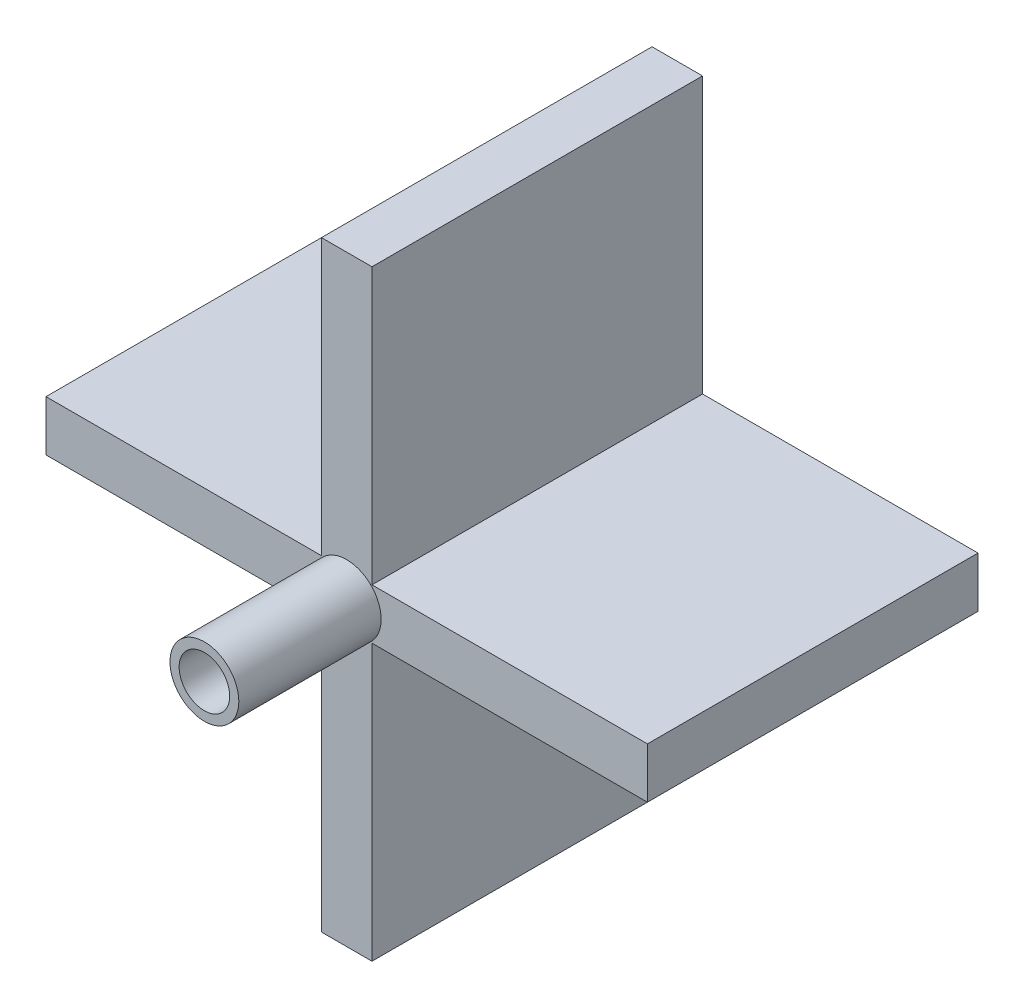
ISO-10303-21;
HEADER;
FILE_DESCRIPTION(('STEP AP214'),'2;1');
FILE_NAME('part.step','',(''),(''),'','','');
FILE_SCHEMA(('AUTOMOTIVE_DESIGN { 1 0 10303 214 1 1 1 1 }'));
ENDSEC;
DATA;
#1=APPLICATION_CONTEXT('core data for automotive mechanical design processes');
#2=APPLICATION_PROTOCOL_DEFINITION('international standard','automotive_design',2000,#1);
#3=PRODUCT_CONTEXT('',#1,'mechanical');
#4=PRODUCT('Part','Part','',(#3));
#5=PRODUCT_RELATED_PRODUCT_CATEGORY('part','',(#4));
#6=PRODUCT_DEFINITION_FORMATION('','',#4);
#7=PRODUCT_DEFINITION_CONTEXT('part definition',#1,'design');
#8=PRODUCT_DEFINITION('design','',#6,#7);
#9=PRODUCT_DEFINITION_SHAPE('','',#8);
#10=(LENGTH_UNIT() NAMED_UNIT(*) SI_UNIT(.MILLI.,.METRE.));
#11=(NAMED_UNIT(*) PLANE_ANGLE_UNIT() SI_UNIT($,.RADIAN.));
#12=(NAMED_UNIT(*) SI_UNIT($,.STERADIAN.) SOLID_ANGLE_UNIT());
#13=UNCERTAINTY_MEASURE_WITH_UNIT(LENGTH_MEASURE(1.E-05),#10,'distance_accuracy_value','');
#14=(GEOMETRIC_REPRESENTATION_CONTEXT(3) GLOBAL_UNCERTAINTY_ASSIGNED_CONTEXT((#13)) GLOBAL_UNIT_ASSIGNED_CONTEXT((#10,
#11,#12)) REPRESENTATION_CONTEXT('',''));
#15=CARTESIAN_POINT('',(0.,0.,0.));
#16=DIRECTION('',(0.,0.,1.));
#17=DIRECTION('',(1.,0.,0.));
#18=AXIS2_PLACEMENT_3D('',#15,#16,#17);
#19=CARTESIAN_POINT('',(-13.9016042764488,5.4909972299169,0.));
#20=DIRECTION('',(0.,0.,1.));
#21=DIRECTION('',(1.,0.,0.));
#22=AXIS2_PLACEMENT_3D('',#19,#20,#21);
#23=CYLINDRICAL_SURFACE('',#22,1.75);
#24=CARTESIAN_POINT('',(-13.9016042764488,5.4909972299169,5.));
#25=DIRECTION('',(0.,0.,-1.));
#26=DIRECTION('',(-1.,0.,0.));
#27=AXIS2_PLACEMENT_3D('',#24,#25,#26);
#28=CIRCLE('',#27,1.75);
#29=CARTESIAN_POINT('',(-15.6516042764488,5.4909972299169,5.));
#30=VERTEX_POINT('',#29);
#31=EDGE_CURVE('E236',#30,#30,#28,.T.);
#32=ORIENTED_EDGE('',*,*,#31,.T.);
#33=EDGE_LOOP('',(#32));
#34=FACE_BOUND('',#33,.T.);
#35=CARTESIAN_POINT('',(-13.9016042764488,5.4909972299169,41.5));
#36=DIRECTION('',(0.,0.,1.));
#37=DIRECTION('',(1.,0.,0.));
#38=AXIS2_PLACEMENT_3D('',#35,#36,#37);
#39=CIRCLE('',#38,1.75);
#40=CARTESIAN_POINT('',(-12.1516042764488,5.4909972299169,41.5));
#41=VERTEX_POINT('',#40);
#42=EDGE_CURVE('E45',#41,#41,#39,.F.);
#43=ORIENTED_EDGE('',*,*,#42,.F.);
#44=EDGE_LOOP('',(#43));
#45=FACE_BOUND('',#44,.T.);
#46=ADVANCED_FACE('F41',(#34,#45),#23,.F.);
#47=CARTESIAN_POINT('',(-11.1516042764488,0.,36.));
#48=DIRECTION('',(1.,0.,0.));
#49=DIRECTION('',(0.,1.,0.));
#50=AXIS2_PLACEMENT_3D('',#47,#48,#49);
#51=PLANE('',#50);
#52=DIRECTION('',(0.,-1.,0.));
#53=VECTOR('',#52,1.);
#54=CARTESIAN_POINT('',(-11.1516042764488,0.,0.));
#55=LINE('',#54,#53);
#56=CARTESIAN_POINT('',(-11.1516042764488,38.2409972299169,0.));
#57=VERTEX_POINT('',#56);
#58=CARTESIAN_POINT('',(-11.1516042764488,8.2409972299169,0.));
#59=VERTEX_POINT('',#58);
#60=EDGE_CURVE('E165',#57,#59,#55,.T.);
#61=ORIENTED_EDGE('',*,*,#60,.F.);
#62=DIRECTION('',(0.,0.,-1.));
#63=VECTOR('',#62,1.);
#64=CARTESIAN_POINT('',(-11.1516042764488,38.2409972299169,36.));
#65=LINE('',#64,#63);
#66=CARTESIAN_POINT('',(-11.1516042764488,38.2409972299169,36.));
#67=VERTEX_POINT('',#66);
#68=EDGE_CURVE('E11',#67,#57,#65,.T.);
#69=ORIENTED_EDGE('',*,*,#68,.F.);
#70=DIRECTION('',(0.,-1.,0.));
#71=VECTOR('',#70,1.);
#72=CARTESIAN_POINT('',(-11.1516042764488,0.,36.));
#73=LINE('',#72,#71);
#74=CARTESIAN_POINT('',(-11.1516042764488,8.2409972299169,36.));
#75=VERTEX_POINT('',#74);
#76=EDGE_CURVE('E207',#67,#75,#73,.T.);
#77=ORIENTED_EDGE('',*,*,#76,.T.);
#78=DIRECTION('',(0.,0.,-1.));
#79=VECTOR('',#78,1.);
#80=CARTESIAN_POINT('',(-11.1516042764488,8.2409972299169,36.));
#81=LINE('',#80,#79);
#82=EDGE_CURVE('E61',#75,#59,#81,.T.);
#83=ORIENTED_EDGE('',*,*,#82,.T.);
#84=EDGE_LOOP('',(#61,#69,#77,#83));
#85=FACE_BOUND('',#84,.T.);
#86=ADVANCED_FACE('F43',(#85),#51,.T.);
#87=CARTESIAN_POINT('',(0.,38.2409972299169,36.));
#88=DIRECTION('',(0.,1.,0.));
#89=DIRECTION('',(-1.,0.,0.));
#90=AXIS2_PLACEMENT_3D('',#87,#88,#89);
#91=PLANE('',#90);
#92=DIRECTION('',(1.,0.,0.));
#93=VECTOR('',#92,1.);
#94=CARTESIAN_POINT('',(0.,38.2409972299169,0.));
#95=LINE('',#94,#93);
#96=CARTESIAN_POINT('',(-16.6516042764488,38.2409972299169,0.));
#97=VERTEX_POINT('',#96);
#98=EDGE_CURVE('E168',#97,#57,#95,.T.);
#99=ORIENTED_EDGE('',*,*,#98,.F.);
#100=DIRECTION('',(0.,0.,-1.));
#101=VECTOR('',#100,1.);
#102=CARTESIAN_POINT('',(-16.6516042764488,38.2409972299169,36.));
#103=LINE('',#102,#101);
#104=CARTESIAN_POINT('',(-16.6516042764488,38.2409972299169,36.));
#105=VERTEX_POINT('',#104);
#106=EDGE_CURVE('E52',#105,#97,#103,.T.);
#107=ORIENTED_EDGE('',*,*,#106,.F.);
#108=DIRECTION('',(1.,0.,0.));
#109=VECTOR('',#108,1.);
#110=CARTESIAN_POINT('',(0.,38.2409972299169,36.));
#111=LINE('',#110,#109);
#112=EDGE_CURVE('E273',#105,#67,#111,.T.);
#113=ORIENTED_EDGE('',*,*,#112,.T.);
#114=ORIENTED_EDGE('',*,*,#68,.T.);
#115=EDGE_LOOP('',(#99,#107,#113,#114));
#116=FACE_BOUND('',#115,.T.);
#117=ADVANCED_FACE('F319',(#116),#91,.T.);
#118=CARTESIAN_POINT('',(-16.6516042764488,0.,36.));
#119=DIRECTION('',(1.,0.,0.));
#120=DIRECTION('',(0.,1.,0.));
#121=AXIS2_PLACEMENT_3D('',#118,#119,#120);
#122=PLANE('',#121);
#123=DIRECTION('',(0.,-1.,0.));
#124=VECTOR('',#123,1.);
#125=CARTESIAN_POINT('',(-16.6516042764488,0.,0.));
#126=LINE('',#125,#124);
#127=CARTESIAN_POINT('',(-16.6516042764488,8.2409972299169,0.));
#128=VERTEX_POINT('',#127);
#129=EDGE_CURVE('E173',#97,#128,#126,.T.);
#130=ORIENTED_EDGE('',*,*,#129,.T.);
#131=DIRECTION('',(0.,0.,-1.));
#132=VECTOR('',#131,1.);
#133=CARTESIAN_POINT('',(-16.6516042764488,8.2409972299169,36.));
#134=LINE('',#133,#132);
#135=CARTESIAN_POINT('',(-16.6516042764488,8.2409972299169,36.));
#136=VERTEX_POINT('',#135);
#137=EDGE_CURVE('E232',#136,#128,#134,.T.);
#138=ORIENTED_EDGE('',*,*,#137,.F.);
#139=DIRECTION('',(0.,-1.,0.));
#140=VECTOR('',#139,1.);
#141=CARTESIAN_POINT('',(-16.6516042764488,0.,36.));
#142=LINE('',#141,#140);
#143=EDGE_CURVE('E277',#105,#136,#142,.T.);
#144=ORIENTED_EDGE('',*,*,#143,.F.);
#145=ORIENTED_EDGE('',*,*,#106,.T.);
#146=EDGE_LOOP('',(#130,#138,#144,#145));
#147=FACE_BOUND('',#146,.T.);
#148=ADVANCED_FACE('F486',(#147),#122,.F.);
#149=CARTESIAN_POINT('',(0.,8.2409972299169,36.));
#150=DIRECTION('',(0.,1.,0.));
#151=DIRECTION('',(0.,0.,1.));
#152=AXIS2_PLACEMENT_3D('',#149,#150,#151);
#153=PLANE('',#152);
#154=DIRECTION('',(1.,0.,0.));
#155=VECTOR('',#154,1.);
#156=CARTESIAN_POINT('',(0.,8.2409972299169,0.));
#157=LINE('',#156,#155);
#158=CARTESIAN_POINT('',(-46.6516042764488,8.2409972299169,0.));
#159=VERTEX_POINT('',#158);
#160=EDGE_CURVE('E177',#159,#128,#157,.T.);
#161=ORIENTED_EDGE('',*,*,#160,.F.);
#162=DIRECTION('',(0.,0.,-1.));
#163=VECTOR('',#162,1.);
#164=CARTESIAN_POINT('',(-46.6516042764488,8.2409972299169,36.));
#165=LINE('',#164,#163);
#166=CARTESIAN_POINT('',(-46.6516042764488,8.2409972299169,36.));
#167=VERTEX_POINT('',#166);
#168=EDGE_CURVE('E229',#167,#159,#165,.T.);
#169=ORIENTED_EDGE('',*,*,#168,.F.);
#170=DIRECTION('',(1.,0.,0.));
#171=VECTOR('',#170,1.);
#172=CARTESIAN_POINT('',(0.,8.2409972299169,36.));
#173=LINE('',#172,#171);
#174=EDGE_CURVE('E280',#167,#136,#173,.T.);
#175=ORIENTED_EDGE('',*,*,#174,.T.);
#176=ORIENTED_EDGE('',*,*,#137,.T.);
#177=EDGE_LOOP('',(#161,#169,#175,#176));
#178=FACE_BOUND('',#177,.T.);
#179=ADVANCED_FACE('F476',(#178),#153,.T.);
#180=CARTESIAN_POINT('',(-46.6516042764488,0.,36.));
#181=DIRECTION('',(1.,0.,0.));
#182=DIRECTION('',(0.,1.,0.));
#183=AXIS2_PLACEMENT_3D('',#180,#181,#182);
#184=PLANE('',#183);
#185=DIRECTION('',(0.,-1.,0.));
#186=VECTOR('',#185,1.);
#187=CARTESIAN_POINT('',(-46.6516042764488,0.,0.));
#188=LINE('',#187,#186);
#189=CARTESIAN_POINT('',(-46.6516042764488,2.7409972299169,0.));
#190=VERTEX_POINT('',#189);
#191=EDGE_CURVE('E181',#159,#190,#188,.T.);
#192=ORIENTED_EDGE('',*,*,#191,.T.);
#193=DIRECTION('',(0.,0.,-1.));
#194=VECTOR('',#193,1.);
#195=CARTESIAN_POINT('',(-46.6516042764488,2.7409972299169,36.));
#196=LINE('',#195,#194);
#197=CARTESIAN_POINT('',(-46.6516042764488,2.7409972299169,36.));
#198=VERTEX_POINT('',#197);
#199=EDGE_CURVE('E225',#198,#190,#196,.T.);
#200=ORIENTED_EDGE('',*,*,#199,.F.);
#201=DIRECTION('',(0.,-1.,0.));
#202=VECTOR('',#201,1.);
#203=CARTESIAN_POINT('',(-46.6516042764488,0.,36.));
#204=LINE('',#203,#202);
#205=EDGE_CURVE('E284',#167,#198,#204,.T.);
#206=ORIENTED_EDGE('',*,*,#205,.F.);
#207=ORIENTED_EDGE('',*,*,#168,.T.);
#208=EDGE_LOOP('',(#192,#200,#206,#207));
#209=FACE_BOUND('',#208,.T.);
#210=ADVANCED_FACE('F466',(#209),#184,.F.);
#211=CARTESIAN_POINT('',(0.,2.7409972299169,36.));
#212=DIRECTION('',(0.,1.,0.));
#213=DIRECTION('',(0.,0.,1.));
#214=AXIS2_PLACEMENT_3D('',#211,#212,#213);
#215=PLANE('',#214);
#216=DIRECTION('',(1.,0.,0.));
#217=VECTOR('',#216,1.);
#218=CARTESIAN_POINT('',(0.,2.7409972299169,0.));
#219=LINE('',#218,#217);
#220=CARTESIAN_POINT('',(-16.6516042764488,2.7409972299169,0.));
#221=VERTEX_POINT('',#220);
#222=EDGE_CURVE('E184',#190,#221,#219,.T.);
#223=ORIENTED_EDGE('',*,*,#222,.T.);
#224=DIRECTION('',(0.,0.,-1.));
#225=VECTOR('',#224,1.);
#226=CARTESIAN_POINT('',(-16.6516042764488,2.7409972299169,36.));
#227=LINE('',#226,#225);
#228=CARTESIAN_POINT('',(-16.6516042764488,2.7409972299169,36.));
#229=VERTEX_POINT('',#228);
#230=EDGE_CURVE('E221',#229,#221,#227,.T.);
#231=ORIENTED_EDGE('',*,*,#230,.F.);
#232=DIRECTION('',(1.,0.,0.));
#233=VECTOR('',#232,1.);
#234=CARTESIAN_POINT('',(0.,2.7409972299169,36.));
#235=LINE('',#234,#233);
#236=EDGE_CURVE('E287',#198,#229,#235,.T.);
#237=ORIENTED_EDGE('',*,*,#236,.F.);
#238=ORIENTED_EDGE('',*,*,#199,.T.);
#239=EDGE_LOOP('',(#223,#231,#237,#238));
#240=FACE_BOUND('',#239,.T.);
#241=ADVANCED_FACE('F456',(#240),#215,.F.);
#242=CARTESIAN_POINT('',(-16.6516042764488,0.,36.));
#243=DIRECTION('',(1.,0.,0.));
#244=DIRECTION('',(0.,1.,0.));
#245=AXIS2_PLACEMENT_3D('',#242,#243,#244);
#246=PLANE('',#245);
#247=DIRECTION('',(0.,-1.,0.));
#248=VECTOR('',#247,1.);
#249=CARTESIAN_POINT('',(-16.6516042764488,0.,0.));
#250=LINE('',#249,#248);
#251=CARTESIAN_POINT('',(-16.6516042764488,-27.2590027700831,0.));
#252=VERTEX_POINT('',#251);
#253=EDGE_CURVE('E187',#221,#252,#250,.T.);
#254=ORIENTED_EDGE('',*,*,#253,.T.);
#255=DIRECTION('',(0.,0.,-1.));
#256=VECTOR('',#255,1.);
#257=CARTESIAN_POINT('',(-16.6516042764488,-27.2590027700831,36.));
#258=LINE('',#257,#256);
#259=CARTESIAN_POINT('',(-16.6516042764488,-27.2590027700831,36.));
#260=VERTEX_POINT('',#259);
#261=EDGE_CURVE('E217',#260,#252,#258,.T.);
#262=ORIENTED_EDGE('',*,*,#261,.F.);
#263=DIRECTION('',(0.,-1.,0.));
#264=VECTOR('',#263,1.);
#265=CARTESIAN_POINT('',(-16.6516042764488,0.,36.));
#266=LINE('',#265,#264);
#267=EDGE_CURVE('E290',#229,#260,#266,.T.);
#268=ORIENTED_EDGE('',*,*,#267,.F.);
#269=ORIENTED_EDGE('',*,*,#230,.T.);
#270=EDGE_LOOP('',(#254,#262,#268,#269));
#271=FACE_BOUND('',#270,.T.);
#272=ADVANCED_FACE('F446',(#271),#246,.F.);
#273=CARTESIAN_POINT('',(0.,-27.2590027700831,36.));
#274=DIRECTION('',(0.,1.,0.));
#275=DIRECTION('',(0.,0.,1.));
#276=AXIS2_PLACEMENT_3D('',#273,#274,#275);
#277=PLANE('',#276);
#278=DIRECTION('',(1.,0.,0.));
#279=VECTOR('',#278,1.);
#280=CARTESIAN_POINT('',(0.,-27.2590027700831,0.));
#281=LINE('',#280,#279);
#282=CARTESIAN_POINT('',(-11.1516042764488,-27.2590027700831,0.));
#283=VERTEX_POINT('',#282);
#284=EDGE_CURVE('E190',#252,#283,#281,.T.);
#285=ORIENTED_EDGE('',*,*,#284,.T.);
#286=DIRECTION('',(0.,0.,-1.));
#287=VECTOR('',#286,1.);
#288=CARTESIAN_POINT('',(-11.1516042764488,-27.2590027700831,36.));
#289=LINE('',#288,#287);
#290=CARTESIAN_POINT('',(-11.1516042764488,-27.2590027700831,36.));
#291=VERTEX_POINT('',#290);
#292=EDGE_CURVE('E214',#291,#283,#289,.T.);
#293=ORIENTED_EDGE('',*,*,#292,.F.);
#294=DIRECTION('',(1.,0.,0.));
#295=VECTOR('',#294,1.);
#296=CARTESIAN_POINT('',(0.,-27.2590027700831,36.));
#297=LINE('',#296,#295);
#298=EDGE_CURVE('E293',#260,#291,#297,.T.);
#299=ORIENTED_EDGE('',*,*,#298,.F.);
#300=ORIENTED_EDGE('',*,*,#261,.T.);
#301=EDGE_LOOP('',(#285,#293,#299,#300));
#302=FACE_BOUND('',#301,.T.);
#303=ADVANCED_FACE('F437',(#302),#277,.F.);
#304=CARTESIAN_POINT('',(-11.1516042764488,0.,36.));
#305=DIRECTION('',(1.,0.,0.));
#306=DIRECTION('',(0.,1.,0.));
#307=AXIS2_PLACEMENT_3D('',#304,#305,#306);
#308=PLANE('',#307);
#309=DIRECTION('',(0.,-1.,0.));
#310=VECTOR('',#309,1.);
#311=CARTESIAN_POINT('',(-11.1516042764488,0.,0.));
#312=LINE('',#311,#310);
#313=CARTESIAN_POINT('',(-11.1516042764488,2.7409972299169,0.));
#314=VERTEX_POINT('',#313);
#315=EDGE_CURVE('E194',#314,#283,#312,.T.);
#316=ORIENTED_EDGE('',*,*,#315,.F.);
#317=DIRECTION('',(0.,0.,-1.));
#318=VECTOR('',#317,1.);
#319=CARTESIAN_POINT('',(-11.1516042764488,2.7409972299169,36.));
#320=LINE('',#319,#318);
#321=CARTESIAN_POINT('',(-11.1516042764488,2.7409972299169,36.));
#322=VERTEX_POINT('',#321);
#323=EDGE_CURVE('E155',#322,#314,#320,.T.);
#324=ORIENTED_EDGE('',*,*,#323,.F.);
#325=DIRECTION('',(0.,-1.,0.));
#326=VECTOR('',#325,1.);
#327=CARTESIAN_POINT('',(-11.1516042764488,0.,36.));
#328=LINE('',#327,#326);
#329=EDGE_CURVE('E143',#322,#291,#328,.T.);
#330=ORIENTED_EDGE('',*,*,#329,.T.);
#331=ORIENTED_EDGE('',*,*,#292,.T.);
#332=EDGE_LOOP('',(#316,#324,#330,#331));
#333=FACE_BOUND('',#332,.T.);
#334=ADVANCED_FACE('F298',(#333),#308,.T.);
#335=CARTESIAN_POINT('',(0.,2.7409972299169,36.));
#336=DIRECTION('',(0.,1.,0.));
#337=DIRECTION('',(0.,0.,1.));
#338=AXIS2_PLACEMENT_3D('',#335,#336,#337);
#339=PLANE('',#338);
#340=DIRECTION('',(1.,0.,0.));
#341=VECTOR('',#340,1.);
#342=CARTESIAN_POINT('',(0.,2.7409972299169,0.));
#343=LINE('',#342,#341);
#344=CARTESIAN_POINT('',(18.8483957235512,2.7409972299169,0.));
#345=VERTEX_POINT('',#344);
#346=EDGE_CURVE('E151',#314,#345,#343,.T.);
#347=ORIENTED_EDGE('',*,*,#346,.T.);
#348=DIRECTION('',(0.,0.,-1.));
#349=VECTOR('',#348,1.);
#350=CARTESIAN_POINT('',(18.8483957235512,2.7409972299169,36.));
#351=LINE('',#350,#349);
#352=CARTESIAN_POINT('',(18.8483957235512,2.7409972299169,36.));
#353=VERTEX_POINT('',#352);
#354=EDGE_CURVE('E148',#353,#345,#351,.T.);
#355=ORIENTED_EDGE('',*,*,#354,.F.);
#356=DIRECTION('',(1.,0.,0.));
#357=VECTOR('',#356,1.);
#358=CARTESIAN_POINT('',(0.,2.7409972299169,36.));
#359=LINE('',#358,#357);
#360=EDGE_CURVE('E136',#322,#353,#359,.T.);
#361=ORIENTED_EDGE('',*,*,#360,.F.);
#362=ORIENTED_EDGE('',*,*,#323,.T.);
#363=EDGE_LOOP('',(#347,#355,#361,#362));
#364=FACE_BOUND('',#363,.T.);
#365=ADVANCED_FACE('F149',(#364),#339,.F.);
#366=CARTESIAN_POINT('',(18.8483957235512,0.,36.));
#367=DIRECTION('',(1.,0.,0.));
#368=DIRECTION('',(0.,1.,0.));
#369=AXIS2_PLACEMENT_3D('',#366,#367,#368);
#370=PLANE('',#369);
#371=DIRECTION('',(0.,-1.,0.));
#372=VECTOR('',#371,1.);
#373=CARTESIAN_POINT('',(18.8483957235512,0.,0.));
#374=LINE('',#373,#372);
#375=CARTESIAN_POINT('',(18.8483957235512,8.2409972299169,0.));
#376=VERTEX_POINT('',#375);
#377=EDGE_CURVE('E200',#376,#345,#374,.T.);
#378=ORIENTED_EDGE('',*,*,#377,.F.);
#379=DIRECTION('',(0.,0.,-1.));
#380=VECTOR('',#379,1.);
#381=CARTESIAN_POINT('',(18.8483957235512,8.2409972299169,36.));
#382=LINE('',#381,#380);
#383=CARTESIAN_POINT('',(18.8483957235512,8.2409972299169,36.));
#384=VERTEX_POINT('',#383);
#385=EDGE_CURVE('E98',#384,#376,#382,.T.);
#386=ORIENTED_EDGE('',*,*,#385,.F.);
#387=DIRECTION('',(0.,-1.,0.));
#388=VECTOR('',#387,1.);
#389=CARTESIAN_POINT('',(18.8483957235512,0.,36.));
#390=LINE('',#389,#388);
#391=EDGE_CURVE('E141',#384,#353,#390,.T.);
#392=ORIENTED_EDGE('',*,*,#391,.T.);
#393=ORIENTED_EDGE('',*,*,#354,.T.);
#394=EDGE_LOOP('',(#378,#386,#392,#393));
#395=FACE_BOUND('',#394,.T.);
#396=ADVANCED_FACE('F157',(#395),#370,.T.);
#397=CARTESIAN_POINT('',(0.,8.2409972299169,36.));
#398=DIRECTION('',(0.,1.,0.));
#399=DIRECTION('',(0.,0.,1.));
#400=AXIS2_PLACEMENT_3D('',#397,#398,#399);
#401=PLANE('',#400);
#402=DIRECTION('',(1.,0.,0.));
#403=VECTOR('',#402,1.);
#404=CARTESIAN_POINT('',(0.,8.2409972299169,0.));
#405=LINE('',#404,#403);
#406=EDGE_CURVE('E203',#59,#376,#405,.T.);
#407=ORIENTED_EDGE('',*,*,#406,.F.);
#408=ORIENTED_EDGE('',*,*,#82,.F.);
#409=DIRECTION('',(1.,0.,0.));
#410=VECTOR('',#409,1.);
#411=CARTESIAN_POINT('',(0.,8.2409972299169,36.));
#412=LINE('',#411,#410);
#413=EDGE_CURVE('E159',#75,#384,#412,.T.);
#414=ORIENTED_EDGE('',*,*,#413,.T.);
#415=ORIENTED_EDGE('',*,*,#385,.T.);
#416=EDGE_LOOP('',(#407,#408,#414,#415));
#417=FACE_BOUND('',#416,.T.);
#418=ADVANCED_FACE('F303',(#417),#401,.T.);
#419=CARTESIAN_POINT('',(0.,0.,36.));
#420=DIRECTION('',(0.,0.,1.));
#421=DIRECTION('',(1.,0.,0.));
#422=AXIS2_PLACEMENT_3D('',#419,#420,#421);
#423=PLANE('',#422);
#424=CARTESIAN_POINT('',(-13.9016042764488,5.4909972299169,36.));
#425=DIRECTION('',(0.,0.,1.));
#426=DIRECTION('',(1.,0.,0.));
#427=AXIS2_PLACEMENT_3D('',#424,#425,#426);
#428=CIRCLE('',#427,3.75);
#429=CARTESIAN_POINT('',(-10.1516042764488,5.4909972299169,36.));
#430=VERTEX_POINT('',#429);
#431=EDGE_CURVE('E263',#430,#430,#428,.T.);
#432=ORIENTED_EDGE('',*,*,#431,.F.);
#433=EDGE_LOOP('',(#432));
#434=FACE_BOUND('',#433,.T.);
#435=ORIENTED_EDGE('',*,*,#76,.F.);
#436=ORIENTED_EDGE('',*,*,#112,.F.);
#437=ORIENTED_EDGE('',*,*,#143,.T.);
#438=ORIENTED_EDGE('',*,*,#174,.F.);
#439=ORIENTED_EDGE('',*,*,#205,.T.);
#440=ORIENTED_EDGE('',*,*,#236,.T.);
#441=ORIENTED_EDGE('',*,*,#267,.T.);
#442=ORIENTED_EDGE('',*,*,#298,.T.);
#443=ORIENTED_EDGE('',*,*,#329,.F.);
#444=ORIENTED_EDGE('',*,*,#360,.T.);
#445=ORIENTED_EDGE('',*,*,#391,.F.);
#446=ORIENTED_EDGE('',*,*,#413,.F.);
#447=EDGE_LOOP('',(#435,#436,#437,#438,#439,#440,#441,#442,#443,#444,#445,#446));
#448=FACE_BOUND('',#447,.T.);
#449=ADVANCED_FACE('F138',(#434,#448),#423,.T.);
#450=CARTESIAN_POINT('',(0.,0.,0.));
#451=DIRECTION('',(0.,0.,1.));
#452=DIRECTION('',(1.,0.,0.));
#453=AXIS2_PLACEMENT_3D('',#450,#451,#452);
#454=PLANE('',#453);
#455=CARTESIAN_POINT('',(-13.9016042764488,5.4909972299169,0.));
#456=DIRECTION('',(0.,0.,-1.));
#457=DIRECTION('',(-1.,0.,0.));
#458=AXIS2_PLACEMENT_3D('',#455,#456,#457);
#459=CIRCLE('',#458,2.85);
#460=CARTESIAN_POINT('',(-16.7516042764488,5.4909972299169,0.));
#461=VERTEX_POINT('',#460);
#462=EDGE_CURVE('E239',#461,#461,#459,.T.);
#463=ORIENTED_EDGE('',*,*,#462,.F.);
#464=EDGE_LOOP('',(#463));
#465=FACE_BOUND('',#464,.T.);
#466=ORIENTED_EDGE('',*,*,#60,.T.);
#467=ORIENTED_EDGE('',*,*,#406,.T.);
#468=ORIENTED_EDGE('',*,*,#377,.T.);
#469=ORIENTED_EDGE('',*,*,#346,.F.);
#470=ORIENTED_EDGE('',*,*,#315,.T.);
#471=ORIENTED_EDGE('',*,*,#284,.F.);
#472=ORIENTED_EDGE('',*,*,#253,.F.);
#473=ORIENTED_EDGE('',*,*,#222,.F.);
#474=ORIENTED_EDGE('',*,*,#191,.F.);
#475=ORIENTED_EDGE('',*,*,#160,.T.);
#476=ORIENTED_EDGE('',*,*,#129,.F.);
#477=ORIENTED_EDGE('',*,*,#98,.T.);
#478=EDGE_LOOP('',(#466,#467,#468,#469,#470,#471,#472,#473,#474,#475,#476,#477));
#479=FACE_BOUND('',#478,.T.);
#480=ADVANCED_FACE('F301',(#465,#479),#454,.F.);
#481=CARTESIAN_POINT('',(-13.9016042764488,5.4909972299169,51.5));
#482=DIRECTION('',(0.,0.,-1.));
#483=DIRECTION('',(-1.,0.,0.));
#484=AXIS2_PLACEMENT_3D('',#481,#482,#483);
#485=CYLINDRICAL_SURFACE('',#484,3.75);
#486=CARTESIAN_POINT('',(-13.9016042764488,5.4909972299169,51.5));
#487=DIRECTION('',(0.,0.,1.));
#488=DIRECTION('',(1.,0.,0.));
#489=AXIS2_PLACEMENT_3D('',#486,#487,#488);
#490=CIRCLE('',#489,3.75);
#491=CARTESIAN_POINT('',(-10.1516042764488,5.4909972299169,51.5));
#492=VERTEX_POINT('',#491);
#493=EDGE_CURVE('E169',#492,#492,#490,.T.);
#494=ORIENTED_EDGE('',*,*,#493,.F.);
#495=EDGE_LOOP('',(#494));
#496=FACE_BOUND('',#495,.T.);
#497=ORIENTED_EDGE('',*,*,#431,.T.);
#498=EDGE_LOOP('',(#497));
#499=FACE_BOUND('',#498,.T.);
#500=ADVANCED_FACE('F337',(#496,#499),#485,.T.);
#501=CARTESIAN_POINT('',(-13.9016042764488,5.4909972299169,51.5));
#502=DIRECTION('',(0.,0.,1.));
#503=DIRECTION('',(1.,0.,0.));
#504=AXIS2_PLACEMENT_3D('',#501,#502,#503);
#505=PLANE('',#504);
#506=CARTESIAN_POINT('',(-13.9016042764488,5.4909972299169,51.5));
#507=DIRECTION('',(0.,0.,1.));
#508=DIRECTION('',(1.,0.,0.));
#509=AXIS2_PLACEMENT_3D('',#506,#507,#508);
#510=CIRCLE('',#509,2.75);
#511=CARTESIAN_POINT('',(-11.1516042764488,5.4909972299169,51.5));
#512=VERTEX_POINT('',#511);
#513=EDGE_CURVE('E253',#512,#512,#510,.T.);
#514=ORIENTED_EDGE('',*,*,#513,.F.);
#515=EDGE_LOOP('',(#514));
#516=FACE_BOUND('',#515,.T.);
#517=ORIENTED_EDGE('',*,*,#493,.T.);
#518=EDGE_LOOP('',(#517));
#519=FACE_BOUND('',#518,.T.);
#520=ADVANCED_FACE('F333',(#516,#519),#505,.T.);
#521=CARTESIAN_POINT('',(-13.9016042764488,5.4909972299169,5.));
#522=DIRECTION('',(0.,0.,-1.));
#523=DIRECTION('',(-1.,0.,0.));
#524=AXIS2_PLACEMENT_3D('',#521,#522,#523);
#525=CYLINDRICAL_SURFACE('',#524,2.85);
#526=CARTESIAN_POINT('',(-13.9016042764488,5.4909972299169,5.));
#527=DIRECTION('',(0.,0.,-1.));
#528=DIRECTION('',(-1.,0.,0.));
#529=AXIS2_PLACEMENT_3D('',#526,#527,#528);
#530=CIRCLE('',#529,2.85);
#531=CARTESIAN_POINT('',(-16.7516042764488,5.4909972299169,5.));
#532=VERTEX_POINT('',#531);
#533=EDGE_CURVE('E245',#532,#532,#530,.T.);
#534=ORIENTED_EDGE('',*,*,#533,.F.);
#535=EDGE_LOOP('',(#534));
#536=FACE_BOUND('',#535,.T.);
#537=ORIENTED_EDGE('',*,*,#462,.T.);
#538=EDGE_LOOP('',(#537));
#539=FACE_BOUND('',#538,.T.);
#540=ADVANCED_FACE('F329',(#536,#539),#525,.F.);
#541=CARTESIAN_POINT('',(-13.9016042764488,5.4909972299169,5.));
#542=DIRECTION('',(0.,0.,-1.));
#543=DIRECTION('',(-1.,0.,0.));
#544=AXIS2_PLACEMENT_3D('',#541,#542,#543);
#545=PLANE('',#544);
#546=ORIENTED_EDGE('',*,*,#31,.F.);
#547=EDGE_LOOP('',(#546));
#548=FACE_BOUND('',#547,.T.);
#549=ORIENTED_EDGE('',*,*,#533,.T.);
#550=EDGE_LOOP('',(#549));
#551=FACE_BOUND('',#550,.T.);
#552=ADVANCED_FACE('F325',(#548,#551),#545,.T.);
#553=CARTESIAN_POINT('',(-13.9016042764488,5.4909972299169,41.5));
#554=DIRECTION('',(0.,0.,1.));
#555=DIRECTION('',(1.,0.,0.));
#556=AXIS2_PLACEMENT_3D('',#553,#554,#555);
#557=PLANE('',#556);
#558=CARTESIAN_POINT('',(-13.9016042764488,5.4909972299169,41.5));
#559=DIRECTION('',(0.,0.,1.));
#560=DIRECTION('',(1.,0.,0.));
#561=AXIS2_PLACEMENT_3D('',#558,#559,#560);
#562=CIRCLE('',#561,2.75);
#563=CARTESIAN_POINT('',(-11.1516042764488,5.4909972299169,41.5));
#564=VERTEX_POINT('',#563);
#565=EDGE_CURVE('E248',#564,#564,#562,.T.);
#566=ORIENTED_EDGE('',*,*,#565,.T.);
#567=EDGE_LOOP('',(#566));
#568=FACE_BOUND('',#567,.T.);
#569=ORIENTED_EDGE('',*,*,#42,.T.);
#570=EDGE_LOOP('',(#569));
#571=FACE_BOUND('',#570,.T.);
#572=ADVANCED_FACE('F328',(#568,#571),#557,.T.);
#573=CARTESIAN_POINT('',(-13.9016042764488,5.4909972299169,41.5));
#574=DIRECTION('',(0.,0.,1.));
#575=DIRECTION('',(1.,0.,0.));
#576=AXIS2_PLACEMENT_3D('',#573,#574,#575);
#577=CYLINDRICAL_SURFACE('',#576,2.75);
#578=ORIENTED_EDGE('',*,*,#565,.F.);
#579=EDGE_LOOP('',(#578));
#580=FACE_BOUND('',#579,.T.);
#581=ORIENTED_EDGE('',*,*,#513,.T.);
#582=EDGE_LOOP('',(#581));
#583=FACE_BOUND('',#582,.T.);
#584=ADVANCED_FACE('F323',(#580,#583),#577,.F.);
#585=CLOSED_SHELL('',(#46,#86,#117,#148,#179,#210,#241,#272,#303,#334,#365,#396,#418,#449,#480,
#500,#520,#540,#552,#572,#584));
#586=MANIFOLD_SOLID_BREP('B2',#585);
#587=ADVANCED_BREP_SHAPE_REPRESENTATION('',(#18,#586),#14);
#588=SHAPE_DEFINITION_REPRESENTATION(#9,#587);
ENDSEC;
END-ISO-10303-21;
